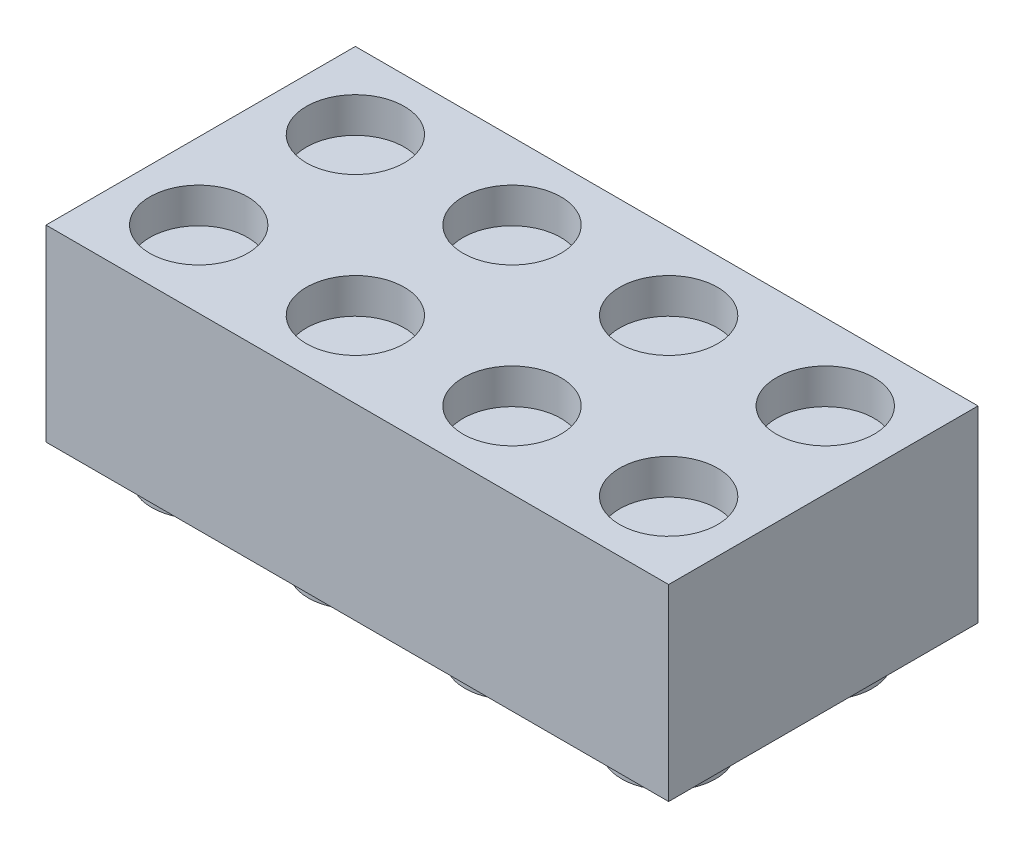
ISO-10303-21;
HEADER;
FILE_DESCRIPTION(('STEP AP214'),'2;1');
FILE_NAME('part.step','',(''),(''),'','','');
FILE_SCHEMA(('AUTOMOTIVE_DESIGN { 1 0 10303 214 1 1 1 1 }'));
ENDSEC;
DATA;
#1=APPLICATION_CONTEXT('core data for automotive mechanical design processes');
#2=APPLICATION_PROTOCOL_DEFINITION('international standard','automotive_design',2000,#1);
#3=PRODUCT_CONTEXT('',#1,'mechanical');
#4=PRODUCT('Part','Part','',(#3));
#5=PRODUCT_RELATED_PRODUCT_CATEGORY('part','',(#4));
#6=PRODUCT_DEFINITION_FORMATION('','',#4);
#7=PRODUCT_DEFINITION_CONTEXT('part definition',#1,'design');
#8=PRODUCT_DEFINITION('design','',#6,#7);
#9=PRODUCT_DEFINITION_SHAPE('','',#8);
#10=(LENGTH_UNIT() NAMED_UNIT(*) SI_UNIT(.MILLI.,.METRE.));
#11=(NAMED_UNIT(*) PLANE_ANGLE_UNIT() SI_UNIT($,.RADIAN.));
#12=(NAMED_UNIT(*) SI_UNIT($,.STERADIAN.) SOLID_ANGLE_UNIT());
#13=UNCERTAINTY_MEASURE_WITH_UNIT(LENGTH_MEASURE(1.E-05),#10,'distance_accuracy_value','');
#14=(GEOMETRIC_REPRESENTATION_CONTEXT(3) GLOBAL_UNCERTAINTY_ASSIGNED_CONTEXT((#13)) GLOBAL_UNIT_ASSIGNED_CONTEXT((#10,
#11,#12)) REPRESENTATION_CONTEXT('',''));
#15=CARTESIAN_POINT('',(0.,0.,0.));
#16=DIRECTION('',(0.,0.,1.));
#17=DIRECTION('',(1.,0.,0.));
#18=AXIS2_PLACEMENT_3D('',#15,#16,#17);
#19=CARTESIAN_POINT('',(0.,9.6,-15.8));
#20=DIRECTION('',(0.,0.,-1.));
#21=DIRECTION('',(-1.,0.,0.));
#22=AXIS2_PLACEMENT_3D('',#19,#20,#21);
#23=PLANE('',#22);
#24=DIRECTION('',(1.,0.,0.));
#25=VECTOR('',#24,1.);
#26=CARTESIAN_POINT('',(0.,0.,-15.8));
#27=LINE('',#26,#25);
#28=CARTESIAN_POINT('',(0.,0.,-15.8));
#29=VERTEX_POINT('',#28);
#30=CARTESIAN_POINT('',(31.8,0.,-15.8));
#31=VERTEX_POINT('',#30);
#32=EDGE_CURVE('E102',#29,#31,#27,.T.);
#33=ORIENTED_EDGE('',*,*,#32,.F.);
#34=DIRECTION('',(0.,-1.,0.));
#35=VECTOR('',#34,1.);
#36=CARTESIAN_POINT('',(0.,9.6,-15.8));
#37=LINE('',#36,#35);
#38=CARTESIAN_POINT('',(0.,9.6,-15.8));
#39=VERTEX_POINT('',#38);
#40=EDGE_CURVE('E50',#39,#29,#37,.T.);
#41=ORIENTED_EDGE('',*,*,#40,.F.);
#42=DIRECTION('',(1.,0.,0.));
#43=VECTOR('',#42,1.);
#44=CARTESIAN_POINT('',(0.,9.6,-15.8));
#45=LINE('',#44,#43);
#46=CARTESIAN_POINT('',(31.8,9.6,-15.8));
#47=VERTEX_POINT('',#46);
#48=EDGE_CURVE('E95',#39,#47,#45,.T.);
#49=ORIENTED_EDGE('',*,*,#48,.T.);
#50=DIRECTION('',(0.,-1.,0.));
#51=VECTOR('',#50,1.);
#52=CARTESIAN_POINT('',(31.8,9.6,-15.8));
#53=LINE('',#52,#51);
#54=EDGE_CURVE('E92',#47,#31,#53,.T.);
#55=ORIENTED_EDGE('',*,*,#54,.T.);
#56=EDGE_LOOP('',(#33,#41,#49,#55));
#57=FACE_BOUND('',#56,.T.);
#58=ADVANCED_FACE('F34',(#57),#23,.T.);
#59=CARTESIAN_POINT('',(0.,9.6,0.));
#60=DIRECTION('',(-1.,0.,0.));
#61=DIRECTION('',(0.,0.,1.));
#62=AXIS2_PLACEMENT_3D('',#59,#60,#61);
#63=PLANE('',#62);
#64=DIRECTION('',(0.,0.,-1.));
#65=VECTOR('',#64,1.);
#66=CARTESIAN_POINT('',(0.,0.,0.));
#67=LINE('',#66,#65);
#68=CARTESIAN_POINT('',(0.,0.,0.));
#69=VERTEX_POINT('',#68);
#70=EDGE_CURVE('E97',#69,#29,#67,.T.);
#71=ORIENTED_EDGE('',*,*,#70,.F.);
#72=DIRECTION('',(0.,-1.,0.));
#73=VECTOR('',#72,1.);
#74=CARTESIAN_POINT('',(0.,9.6,0.));
#75=LINE('',#74,#73);
#76=CARTESIAN_POINT('',(0.,9.6,0.));
#77=VERTEX_POINT('',#76);
#78=EDGE_CURVE('E66',#77,#69,#75,.T.);
#79=ORIENTED_EDGE('',*,*,#78,.F.);
#80=DIRECTION('',(0.,0.,-1.));
#81=VECTOR('',#80,1.);
#82=CARTESIAN_POINT('',(0.,9.6,0.));
#83=LINE('',#82,#81);
#84=EDGE_CURVE('E83',#77,#39,#83,.T.);
#85=ORIENTED_EDGE('',*,*,#84,.T.);
#86=ORIENTED_EDGE('',*,*,#40,.T.);
#87=EDGE_LOOP('',(#71,#79,#85,#86));
#88=FACE_BOUND('',#87,.T.);
#89=ADVANCED_FACE('F154',(#88),#63,.T.);
#90=CARTESIAN_POINT('',(0.,9.6,0.));
#91=DIRECTION('',(0.,0.,-1.));
#92=DIRECTION('',(-1.,0.,0.));
#93=AXIS2_PLACEMENT_3D('',#90,#91,#92);
#94=PLANE('',#93);
#95=DIRECTION('',(1.,0.,0.));
#96=VECTOR('',#95,1.);
#97=CARTESIAN_POINT('',(0.,0.,0.));
#98=LINE('',#97,#96);
#99=CARTESIAN_POINT('',(31.8,0.,0.));
#100=VERTEX_POINT('',#99);
#101=EDGE_CURVE('E88',#69,#100,#98,.T.);
#102=ORIENTED_EDGE('',*,*,#101,.T.);
#103=DIRECTION('',(0.,-1.,0.));
#104=VECTOR('',#103,1.);
#105=CARTESIAN_POINT('',(31.8,9.6,0.));
#106=LINE('',#105,#104);
#107=CARTESIAN_POINT('',(31.8,9.6,0.));
#108=VERTEX_POINT('',#107);
#109=EDGE_CURVE('E86',#108,#100,#106,.T.);
#110=ORIENTED_EDGE('',*,*,#109,.F.);
#111=DIRECTION('',(1.,0.,0.));
#112=VECTOR('',#111,1.);
#113=CARTESIAN_POINT('',(0.,9.6,0.));
#114=LINE('',#113,#112);
#115=EDGE_CURVE('E80',#77,#108,#114,.T.);
#116=ORIENTED_EDGE('',*,*,#115,.F.);
#117=ORIENTED_EDGE('',*,*,#78,.T.);
#118=EDGE_LOOP('',(#102,#110,#116,#117));
#119=FACE_BOUND('',#118,.T.);
#120=ADVANCED_FACE('F87',(#119),#94,.F.);
#121=CARTESIAN_POINT('',(31.8,9.6,0.));
#122=DIRECTION('',(-1.,0.,0.));
#123=DIRECTION('',(0.,0.,1.));
#124=AXIS2_PLACEMENT_3D('',#121,#122,#123);
#125=PLANE('',#124);
#126=DIRECTION('',(0.,0.,-1.));
#127=VECTOR('',#126,1.);
#128=CARTESIAN_POINT('',(31.8,0.,0.));
#129=LINE('',#128,#127);
#130=EDGE_CURVE('E105',#100,#31,#129,.T.);
#131=ORIENTED_EDGE('',*,*,#130,.T.);
#132=ORIENTED_EDGE('',*,*,#54,.F.);
#133=DIRECTION('',(0.,0.,-1.));
#134=VECTOR('',#133,1.);
#135=CARTESIAN_POINT('',(31.8,9.6,0.));
#136=LINE('',#135,#134);
#137=EDGE_CURVE('E77',#108,#47,#136,.T.);
#138=ORIENTED_EDGE('',*,*,#137,.F.);
#139=ORIENTED_EDGE('',*,*,#109,.T.);
#140=EDGE_LOOP('',(#131,#132,#138,#139));
#141=FACE_BOUND('',#140,.T.);
#142=ADVANCED_FACE('F94',(#141),#125,.F.);
#143=CARTESIAN_POINT('',(0.,9.6,0.));
#144=DIRECTION('',(0.,1.,0.));
#145=DIRECTION('',(0.,0.,1.));
#146=AXIS2_PLACEMENT_3D('',#143,#144,#145);
#147=PLANE('',#146);
#148=CARTESIAN_POINT('',(19.9,9.6,-11.8999999999999));
#149=DIRECTION('',(0.,1.,0.));
#150=DIRECTION('',(0.,0.,1.));
#151=AXIS2_PLACEMENT_3D('',#148,#149,#150);
#152=CIRCLE('',#151,2.5);
#153=CARTESIAN_POINT('',(19.9,9.6,-9.39999999999995));
#154=VERTEX_POINT('',#153);
#155=EDGE_CURVE('E303',#154,#154,#152,.T.);
#156=ORIENTED_EDGE('',*,*,#155,.F.);
#157=EDGE_LOOP('',(#156));
#158=FACE_BOUND('',#157,.T.);
#159=CARTESIAN_POINT('',(3.9,9.6,-3.89999999999983));
#160=DIRECTION('',(0.,1.,0.));
#161=DIRECTION('',(0.,0.,1.));
#162=AXIS2_PLACEMENT_3D('',#159,#160,#161);
#163=CIRCLE('',#162,2.5);
#164=CARTESIAN_POINT('',(3.9,9.6,-1.39999999999983));
#165=VERTEX_POINT('',#164);
#166=EDGE_CURVE('E328',#165,#165,#163,.T.);
#167=ORIENTED_EDGE('',*,*,#166,.F.);
#168=EDGE_LOOP('',(#167));
#169=FACE_BOUND('',#168,.T.);
#170=CARTESIAN_POINT('',(11.9,9.6,-3.89999999999989));
#171=DIRECTION('',(0.,1.,0.));
#172=DIRECTION('',(0.,0.,1.));
#173=AXIS2_PLACEMENT_3D('',#170,#171,#172);
#174=CIRCLE('',#173,2.5);
#175=CARTESIAN_POINT('',(11.9,9.6,-1.39999999999989));
#176=VERTEX_POINT('',#175);
#177=EDGE_CURVE('E327',#176,#176,#174,.T.);
#178=ORIENTED_EDGE('',*,*,#177,.F.);
#179=EDGE_LOOP('',(#178));
#180=FACE_BOUND('',#179,.T.);
#181=CARTESIAN_POINT('',(19.9,9.6,-3.89999999999994));
#182=DIRECTION('',(0.,1.,0.));
#183=DIRECTION('',(0.,0.,1.));
#184=AXIS2_PLACEMENT_3D('',#181,#182,#183);
#185=CIRCLE('',#184,2.5);
#186=CARTESIAN_POINT('',(19.9,9.6,-1.39999999999995));
#187=VERTEX_POINT('',#186);
#188=EDGE_CURVE('E337',#187,#187,#185,.T.);
#189=ORIENTED_EDGE('',*,*,#188,.F.);
#190=EDGE_LOOP('',(#189));
#191=FACE_BOUND('',#190,.T.);
#192=CARTESIAN_POINT('',(11.9,9.6,-11.8999999999999));
#193=DIRECTION('',(0.,1.,0.));
#194=DIRECTION('',(0.,0.,1.));
#195=AXIS2_PLACEMENT_3D('',#192,#193,#194);
#196=CIRCLE('',#195,2.5);
#197=CARTESIAN_POINT('',(11.9,9.6,-9.39999999999989));
#198=VERTEX_POINT('',#197);
#199=EDGE_CURVE('E304',#198,#198,#196,.T.);
#200=ORIENTED_EDGE('',*,*,#199,.F.);
#201=EDGE_LOOP('',(#200));
#202=FACE_BOUND('',#201,.T.);
#203=CARTESIAN_POINT('',(3.89999999999997,9.6,-11.8999999999998));
#204=DIRECTION('',(0.,1.,0.));
#205=DIRECTION('',(0.,0.,1.));
#206=AXIS2_PLACEMENT_3D('',#203,#204,#205);
#207=CIRCLE('',#206,2.5);
#208=CARTESIAN_POINT('',(3.89999999999997,9.6,-9.39999999999983));
#209=VERTEX_POINT('',#208);
#210=EDGE_CURVE('E315',#209,#209,#207,.T.);
#211=ORIENTED_EDGE('',*,*,#210,.F.);
#212=EDGE_LOOP('',(#211));
#213=FACE_BOUND('',#212,.T.);
#214=CARTESIAN_POINT('',(27.9,9.6,-11.9));
#215=DIRECTION('',(0.,1.,0.));
#216=DIRECTION('',(0.,0.,1.));
#217=AXIS2_PLACEMENT_3D('',#214,#215,#216);
#218=CIRCLE('',#217,2.5);
#219=CARTESIAN_POINT('',(27.9,9.6,-9.4));
#220=VERTEX_POINT('',#219);
#221=EDGE_CURVE('E321',#220,#220,#218,.T.);
#222=ORIENTED_EDGE('',*,*,#221,.F.);
#223=EDGE_LOOP('',(#222));
#224=FACE_BOUND('',#223,.T.);
#225=CARTESIAN_POINT('',(27.9,9.6,-3.9));
#226=DIRECTION('',(0.,1.,0.));
#227=DIRECTION('',(0.,0.,1.));
#228=AXIS2_PLACEMENT_3D('',#225,#226,#227);
#229=CIRCLE('',#228,2.5);
#230=CARTESIAN_POINT('',(27.9,9.6,-1.4));
#231=VERTEX_POINT('',#230);
#232=EDGE_CURVE('E336',#231,#231,#229,.T.);
#233=ORIENTED_EDGE('',*,*,#232,.F.);
#234=EDGE_LOOP('',(#233));
#235=FACE_BOUND('',#234,.T.);
#236=ORIENTED_EDGE('',*,*,#48,.F.);
#237=ORIENTED_EDGE('',*,*,#84,.F.);
#238=ORIENTED_EDGE('',*,*,#115,.T.);
#239=ORIENTED_EDGE('',*,*,#137,.T.);
#240=EDGE_LOOP('',(#236,#237,#238,#239));
#241=FACE_BOUND('',#240,.T.);
#242=ADVANCED_FACE('F82',(#158,#169,#180,#191,#202,#213,#224,#235,#241),#147,.T.);
#243=CARTESIAN_POINT('',(0.,0.,0.));
#244=DIRECTION('',(0.,1.,0.));
#245=DIRECTION('',(0.,0.,1.));
#246=AXIS2_PLACEMENT_3D('',#243,#244,#245);
#247=PLANE('',#246);
#248=CARTESIAN_POINT('',(27.9000000000001,0.,-11.9));
#249=DIRECTION('',(0.,1.,0.));
#250=DIRECTION('',(0.,0.,1.));
#251=AXIS2_PLACEMENT_3D('',#248,#249,#250);
#252=CIRCLE('',#251,2.4);
#253=CARTESIAN_POINT('',(27.9000000000001,0.,-9.5));
#254=VERTEX_POINT('',#253);
#255=EDGE_CURVE('E11',#254,#254,#252,.F.);
#256=ORIENTED_EDGE('',*,*,#255,.F.);
#257=EDGE_LOOP('',(#256));
#258=FACE_BOUND('',#257,.T.);
#259=CARTESIAN_POINT('',(3.90000000000008,0.,-11.9000000000002));
#260=DIRECTION('',(0.,1.,0.));
#261=DIRECTION('',(0.,0.,1.));
#262=AXIS2_PLACEMENT_3D('',#259,#260,#261);
#263=CIRCLE('',#262,2.4);
#264=CARTESIAN_POINT('',(3.90000000000008,0.,-9.50000000000017));
#265=VERTEX_POINT('',#264);
#266=EDGE_CURVE('E42',#265,#265,#263,.F.);
#267=ORIENTED_EDGE('',*,*,#266,.F.);
#268=EDGE_LOOP('',(#267));
#269=FACE_BOUND('',#268,.T.);
#270=CARTESIAN_POINT('',(11.9000000000001,0.,-11.9000000000001));
#271=DIRECTION('',(0.,1.,0.));
#272=DIRECTION('',(0.,0.,1.));
#273=AXIS2_PLACEMENT_3D('',#270,#271,#272);
#274=CIRCLE('',#273,2.4);
#275=CARTESIAN_POINT('',(11.9000000000001,0.,-9.50000000000011));
#276=VERTEX_POINT('',#275);
#277=EDGE_CURVE('E129',#276,#276,#274,.F.);
#278=ORIENTED_EDGE('',*,*,#277,.F.);
#279=EDGE_LOOP('',(#278));
#280=FACE_BOUND('',#279,.T.);
#281=CARTESIAN_POINT('',(19.9000000000001,0.,-11.9000000000001));
#282=DIRECTION('',(0.,1.,0.));
#283=DIRECTION('',(0.,0.,1.));
#284=AXIS2_PLACEMENT_3D('',#281,#282,#283);
#285=CIRCLE('',#284,2.4);
#286=CARTESIAN_POINT('',(19.9000000000001,0.,-9.50000000000006));
#287=VERTEX_POINT('',#286);
#288=EDGE_CURVE('E126',#287,#287,#285,.F.);
#289=ORIENTED_EDGE('',*,*,#288,.F.);
#290=EDGE_LOOP('',(#289));
#291=FACE_BOUND('',#290,.T.);
#292=CARTESIAN_POINT('',(3.9,0.,-3.90000000000017));
#293=DIRECTION('',(0.,1.,0.));
#294=DIRECTION('',(0.,0.,1.));
#295=AXIS2_PLACEMENT_3D('',#292,#293,#294);
#296=CIRCLE('',#295,2.4);
#297=CARTESIAN_POINT('',(3.9,0.,-1.50000000000017));
#298=VERTEX_POINT('',#297);
#299=EDGE_CURVE('E123',#298,#298,#296,.F.);
#300=ORIENTED_EDGE('',*,*,#299,.F.);
#301=EDGE_LOOP('',(#300));
#302=FACE_BOUND('',#301,.T.);
#303=CARTESIAN_POINT('',(11.9,0.,-3.90000000000011));
#304=DIRECTION('',(0.,1.,0.));
#305=DIRECTION('',(0.,0.,1.));
#306=AXIS2_PLACEMENT_3D('',#303,#304,#305);
#307=CIRCLE('',#306,2.4);
#308=CARTESIAN_POINT('',(11.9,0.,-1.50000000000011));
#309=VERTEX_POINT('',#308);
#310=EDGE_CURVE('E120',#309,#309,#307,.F.);
#311=ORIENTED_EDGE('',*,*,#310,.F.);
#312=EDGE_LOOP('',(#311));
#313=FACE_BOUND('',#312,.T.);
#314=CARTESIAN_POINT('',(19.9,0.,-3.90000000000006));
#315=DIRECTION('',(0.,1.,0.));
#316=DIRECTION('',(0.,0.,1.));
#317=AXIS2_PLACEMENT_3D('',#314,#315,#316);
#318=CIRCLE('',#317,2.4);
#319=CARTESIAN_POINT('',(19.9,0.,-1.50000000000006));
#320=VERTEX_POINT('',#319);
#321=EDGE_CURVE('E117',#320,#320,#318,.F.);
#322=ORIENTED_EDGE('',*,*,#321,.F.);
#323=EDGE_LOOP('',(#322));
#324=FACE_BOUND('',#323,.T.);
#325=CARTESIAN_POINT('',(27.9,0.,-3.9));
#326=DIRECTION('',(0.,1.,0.));
#327=DIRECTION('',(0.,0.,1.));
#328=AXIS2_PLACEMENT_3D('',#325,#326,#327);
#329=CIRCLE('',#328,2.4);
#330=CARTESIAN_POINT('',(27.9,0.,-1.5));
#331=VERTEX_POINT('',#330);
#332=EDGE_CURVE('E112',#331,#331,#329,.F.);
#333=ORIENTED_EDGE('',*,*,#332,.F.);
#334=EDGE_LOOP('',(#333));
#335=FACE_BOUND('',#334,.T.);
#336=ORIENTED_EDGE('',*,*,#32,.T.);
#337=ORIENTED_EDGE('',*,*,#130,.F.);
#338=ORIENTED_EDGE('',*,*,#101,.F.);
#339=ORIENTED_EDGE('',*,*,#70,.T.);
#340=EDGE_LOOP('',(#336,#337,#338,#339));
#341=FACE_BOUND('',#340,.T.);
#342=ADVANCED_FACE('F136',(#258,#269,#280,#291,#302,#313,#324,#335,#341),#247,.F.);
#343=CARTESIAN_POINT('',(27.9,-1.7,-3.9));
#344=DIRECTION('',(0.,1.,0.));
#345=DIRECTION('',(0.,0.,1.));
#346=AXIS2_PLACEMENT_3D('',#343,#344,#345);
#347=CYLINDRICAL_SURFACE('',#346,2.4);
#348=CARTESIAN_POINT('',(27.9,-1.7,-3.9));
#349=DIRECTION('',(0.,-1.,0.));
#350=DIRECTION('',(0.,0.,-1.));
#351=AXIS2_PLACEMENT_3D('',#348,#349,#350);
#352=CIRCLE('',#351,2.4);
#353=CARTESIAN_POINT('',(27.9,-1.7,-6.3));
#354=VERTEX_POINT('',#353);
#355=EDGE_CURVE('E106',#354,#354,#352,.T.);
#356=ORIENTED_EDGE('',*,*,#355,.F.);
#357=EDGE_LOOP('',(#356));
#358=FACE_BOUND('',#357,.T.);
#359=ORIENTED_EDGE('',*,*,#332,.T.);
#360=EDGE_LOOP('',(#359));
#361=FACE_BOUND('',#360,.T.);
#362=ADVANCED_FACE('F139',(#358,#361),#347,.T.);
#363=CARTESIAN_POINT('',(27.9,-1.7,-3.9));
#364=DIRECTION('',(0.,-1.,0.));
#365=DIRECTION('',(0.,0.,-1.));
#366=AXIS2_PLACEMENT_3D('',#363,#364,#365);
#367=PLANE('',#366);
#368=ORIENTED_EDGE('',*,*,#355,.T.);
#369=EDGE_LOOP('',(#368));
#370=FACE_BOUND('',#369,.T.);
#371=ADVANCED_FACE('F175',(#370),#367,.T.);
#372=CARTESIAN_POINT('',(19.9,-1.7,-3.90000000000006));
#373=DIRECTION('',(0.,1.,0.));
#374=DIRECTION('',(0.,0.,1.));
#375=AXIS2_PLACEMENT_3D('',#372,#373,#374);
#376=CYLINDRICAL_SURFACE('',#375,2.4);
#377=CARTESIAN_POINT('',(19.9,-1.7,-3.90000000000006));
#378=DIRECTION('',(0.,-1.,0.));
#379=DIRECTION('',(0.,0.,-1.));
#380=AXIS2_PLACEMENT_3D('',#377,#378,#379);
#381=CIRCLE('',#380,2.4);
#382=CARTESIAN_POINT('',(19.9,-1.7,-6.30000000000006));
#383=VERTEX_POINT('',#382);
#384=EDGE_CURVE('E368',#383,#383,#381,.T.);
#385=ORIENTED_EDGE('',*,*,#384,.F.);
#386=EDGE_LOOP('',(#385));
#387=FACE_BOUND('',#386,.T.);
#388=ORIENTED_EDGE('',*,*,#321,.T.);
#389=EDGE_LOOP('',(#388));
#390=FACE_BOUND('',#389,.T.);
#391=ADVANCED_FACE('F179',(#387,#390),#376,.T.);
#392=CARTESIAN_POINT('',(19.9,-1.7,-3.90000000000006));
#393=DIRECTION('',(0.,-1.,0.));
#394=DIRECTION('',(0.,0.,-1.));
#395=AXIS2_PLACEMENT_3D('',#392,#393,#394);
#396=PLANE('',#395);
#397=ORIENTED_EDGE('',*,*,#384,.T.);
#398=EDGE_LOOP('',(#397));
#399=FACE_BOUND('',#398,.T.);
#400=ADVANCED_FACE('F183',(#399),#396,.T.);
#401=CARTESIAN_POINT('',(11.9,-1.7,-3.90000000000011));
#402=DIRECTION('',(0.,1.,0.));
#403=DIRECTION('',(0.,0.,1.));
#404=AXIS2_PLACEMENT_3D('',#401,#402,#403);
#405=CYLINDRICAL_SURFACE('',#404,2.4);
#406=CARTESIAN_POINT('',(11.9,-1.7,-3.90000000000011));
#407=DIRECTION('',(0.,-1.,0.));
#408=DIRECTION('',(0.,0.,-1.));
#409=AXIS2_PLACEMENT_3D('',#406,#407,#408);
#410=CIRCLE('',#409,2.4);
#411=CARTESIAN_POINT('',(11.9,-1.7,-6.30000000000011));
#412=VERTEX_POINT('',#411);
#413=EDGE_CURVE('E365',#412,#412,#410,.T.);
#414=ORIENTED_EDGE('',*,*,#413,.F.);
#415=EDGE_LOOP('',(#414));
#416=FACE_BOUND('',#415,.T.);
#417=ORIENTED_EDGE('',*,*,#310,.T.);
#418=EDGE_LOOP('',(#417));
#419=FACE_BOUND('',#418,.T.);
#420=ADVANCED_FACE('F187',(#416,#419),#405,.T.);
#421=CARTESIAN_POINT('',(11.9,-1.7,-3.90000000000011));
#422=DIRECTION('',(0.,-1.,0.));
#423=DIRECTION('',(0.,0.,-1.));
#424=AXIS2_PLACEMENT_3D('',#421,#422,#423);
#425=PLANE('',#424);
#426=ORIENTED_EDGE('',*,*,#413,.T.);
#427=EDGE_LOOP('',(#426));
#428=FACE_BOUND('',#427,.T.);
#429=ADVANCED_FACE('F191',(#428),#425,.T.);
#430=CARTESIAN_POINT('',(3.9,-1.7,-3.90000000000017));
#431=DIRECTION('',(0.,1.,0.));
#432=DIRECTION('',(0.,0.,1.));
#433=AXIS2_PLACEMENT_3D('',#430,#431,#432);
#434=CYLINDRICAL_SURFACE('',#433,2.4);
#435=CARTESIAN_POINT('',(3.9,-1.7,-3.90000000000017));
#436=DIRECTION('',(0.,-1.,0.));
#437=DIRECTION('',(0.,0.,-1.));
#438=AXIS2_PLACEMENT_3D('',#435,#436,#437);
#439=CIRCLE('',#438,2.4);
#440=CARTESIAN_POINT('',(3.9,-1.7,-6.30000000000017));
#441=VERTEX_POINT('',#440);
#442=EDGE_CURVE('E362',#441,#441,#439,.T.);
#443=ORIENTED_EDGE('',*,*,#442,.F.);
#444=EDGE_LOOP('',(#443));
#445=FACE_BOUND('',#444,.T.);
#446=ORIENTED_EDGE('',*,*,#299,.T.);
#447=EDGE_LOOP('',(#446));
#448=FACE_BOUND('',#447,.T.);
#449=ADVANCED_FACE('F195',(#445,#448),#434,.T.);
#450=CARTESIAN_POINT('',(3.9,-1.7,-3.90000000000017));
#451=DIRECTION('',(0.,-1.,0.));
#452=DIRECTION('',(0.,0.,-1.));
#453=AXIS2_PLACEMENT_3D('',#450,#451,#452);
#454=PLANE('',#453);
#455=ORIENTED_EDGE('',*,*,#442,.T.);
#456=EDGE_LOOP('',(#455));
#457=FACE_BOUND('',#456,.T.);
#458=ADVANCED_FACE('F199',(#457),#454,.T.);
#459=CARTESIAN_POINT('',(19.9000000000001,-1.7,-11.9000000000001));
#460=DIRECTION('',(0.,1.,0.));
#461=DIRECTION('',(0.,0.,1.));
#462=AXIS2_PLACEMENT_3D('',#459,#460,#461);
#463=CYLINDRICAL_SURFACE('',#462,2.4);
#464=CARTESIAN_POINT('',(19.9000000000001,-1.7,-11.9000000000001));
#465=DIRECTION('',(0.,-1.,0.));
#466=DIRECTION('',(0.,0.,-1.));
#467=AXIS2_PLACEMENT_3D('',#464,#465,#466);
#468=CIRCLE('',#467,2.4);
#469=CARTESIAN_POINT('',(19.9000000000001,-1.7,-14.3000000000001));
#470=VERTEX_POINT('',#469);
#471=EDGE_CURVE('E359',#470,#470,#468,.T.);
#472=ORIENTED_EDGE('',*,*,#471,.F.);
#473=EDGE_LOOP('',(#472));
#474=FACE_BOUND('',#473,.T.);
#475=ORIENTED_EDGE('',*,*,#288,.T.);
#476=EDGE_LOOP('',(#475));
#477=FACE_BOUND('',#476,.T.);
#478=ADVANCED_FACE('F203',(#474,#477),#463,.T.);
#479=CARTESIAN_POINT('',(19.9000000000001,-1.7,-11.9000000000001));
#480=DIRECTION('',(0.,-1.,0.));
#481=DIRECTION('',(0.,0.,-1.));
#482=AXIS2_PLACEMENT_3D('',#479,#480,#481);
#483=PLANE('',#482);
#484=ORIENTED_EDGE('',*,*,#471,.T.);
#485=EDGE_LOOP('',(#484));
#486=FACE_BOUND('',#485,.T.);
#487=ADVANCED_FACE('F207',(#486),#483,.T.);
#488=CARTESIAN_POINT('',(11.9000000000001,-1.7,-11.9000000000001));
#489=DIRECTION('',(0.,1.,0.));
#490=DIRECTION('',(0.,0.,1.));
#491=AXIS2_PLACEMENT_3D('',#488,#489,#490);
#492=CYLINDRICAL_SURFACE('',#491,2.4);
#493=CARTESIAN_POINT('',(11.9000000000001,-1.7,-11.9000000000001));
#494=DIRECTION('',(0.,-1.,0.));
#495=DIRECTION('',(0.,0.,-1.));
#496=AXIS2_PLACEMENT_3D('',#493,#494,#495);
#497=CIRCLE('',#496,2.4);
#498=CARTESIAN_POINT('',(11.9000000000001,-1.7,-14.3000000000001));
#499=VERTEX_POINT('',#498);
#500=EDGE_CURVE('E356',#499,#499,#497,.T.);
#501=ORIENTED_EDGE('',*,*,#500,.F.);
#502=EDGE_LOOP('',(#501));
#503=FACE_BOUND('',#502,.T.);
#504=ORIENTED_EDGE('',*,*,#277,.T.);
#505=EDGE_LOOP('',(#504));
#506=FACE_BOUND('',#505,.T.);
#507=ADVANCED_FACE('F211',(#503,#506),#492,.T.);
#508=CARTESIAN_POINT('',(11.9000000000001,-1.7,-11.9000000000001));
#509=DIRECTION('',(0.,-1.,0.));
#510=DIRECTION('',(0.,0.,-1.));
#511=AXIS2_PLACEMENT_3D('',#508,#509,#510);
#512=PLANE('',#511);
#513=ORIENTED_EDGE('',*,*,#500,.T.);
#514=EDGE_LOOP('',(#513));
#515=FACE_BOUND('',#514,.T.);
#516=ADVANCED_FACE('F215',(#515),#512,.T.);
#517=CARTESIAN_POINT('',(3.90000000000008,-1.7,-11.9000000000002));
#518=DIRECTION('',(0.,1.,0.));
#519=DIRECTION('',(0.,0.,1.));
#520=AXIS2_PLACEMENT_3D('',#517,#518,#519);
#521=CYLINDRICAL_SURFACE('',#520,2.4);
#522=CARTESIAN_POINT('',(3.90000000000008,-1.7,-11.9000000000002));
#523=DIRECTION('',(0.,-1.,0.));
#524=DIRECTION('',(0.,0.,-1.));
#525=AXIS2_PLACEMENT_3D('',#522,#523,#524);
#526=CIRCLE('',#525,2.4);
#527=CARTESIAN_POINT('',(3.90000000000008,-1.7,-14.3000000000002));
#528=VERTEX_POINT('',#527);
#529=EDGE_CURVE('E353',#528,#528,#526,.T.);
#530=ORIENTED_EDGE('',*,*,#529,.F.);
#531=EDGE_LOOP('',(#530));
#532=FACE_BOUND('',#531,.T.);
#533=ORIENTED_EDGE('',*,*,#266,.T.);
#534=EDGE_LOOP('',(#533));
#535=FACE_BOUND('',#534,.T.);
#536=ADVANCED_FACE('F134',(#532,#535),#521,.T.);
#537=CARTESIAN_POINT('',(3.90000000000008,-1.7,-11.9000000000002));
#538=DIRECTION('',(0.,-1.,0.));
#539=DIRECTION('',(0.,0.,-1.));
#540=AXIS2_PLACEMENT_3D('',#537,#538,#539);
#541=PLANE('',#540);
#542=ORIENTED_EDGE('',*,*,#529,.T.);
#543=EDGE_LOOP('',(#542));
#544=FACE_BOUND('',#543,.T.);
#545=ADVANCED_FACE('F222',(#544),#541,.T.);
#546=CARTESIAN_POINT('',(27.9000000000001,-1.7,-11.9));
#547=DIRECTION('',(0.,1.,0.));
#548=DIRECTION('',(0.,0.,1.));
#549=AXIS2_PLACEMENT_3D('',#546,#547,#548);
#550=CYLINDRICAL_SURFACE('',#549,2.4);
#551=CARTESIAN_POINT('',(27.9000000000001,-1.7,-11.9));
#552=DIRECTION('',(0.,-1.,0.));
#553=DIRECTION('',(0.,0.,-1.));
#554=AXIS2_PLACEMENT_3D('',#551,#552,#553);
#555=CIRCLE('',#554,2.4);
#556=CARTESIAN_POINT('',(27.9000000000001,-1.7,-14.3));
#557=VERTEX_POINT('',#556);
#558=EDGE_CURVE('E348',#557,#557,#555,.T.);
#559=ORIENTED_EDGE('',*,*,#558,.F.);
#560=EDGE_LOOP('',(#559));
#561=FACE_BOUND('',#560,.T.);
#562=ORIENTED_EDGE('',*,*,#255,.T.);
#563=EDGE_LOOP('',(#562));
#564=FACE_BOUND('',#563,.T.);
#565=ADVANCED_FACE('F226',(#561,#564),#550,.T.);
#566=CARTESIAN_POINT('',(27.9000000000001,-1.7,-11.9));
#567=DIRECTION('',(0.,-1.,0.));
#568=DIRECTION('',(0.,0.,-1.));
#569=AXIS2_PLACEMENT_3D('',#566,#567,#568);
#570=PLANE('',#569);
#571=ORIENTED_EDGE('',*,*,#558,.T.);
#572=EDGE_LOOP('',(#571));
#573=FACE_BOUND('',#572,.T.);
#574=ADVANCED_FACE('F230',(#573),#570,.T.);
#575=CARTESIAN_POINT('',(27.9,7.8,-3.9));
#576=DIRECTION('',(0.,1.,0.));
#577=DIRECTION('',(0.,0.,1.));
#578=AXIS2_PLACEMENT_3D('',#575,#576,#577);
#579=CYLINDRICAL_SURFACE('',#578,2.5);
#580=CARTESIAN_POINT('',(27.9,7.8,-3.9));
#581=DIRECTION('',(0.,1.,0.));
#582=DIRECTION('',(0.,0.,1.));
#583=AXIS2_PLACEMENT_3D('',#580,#581,#582);
#584=CIRCLE('',#583,2.5);
#585=CARTESIAN_POINT('',(27.9,7.8,-1.4));
#586=VERTEX_POINT('',#585);
#587=EDGE_CURVE('E345',#586,#586,#584,.T.);
#588=ORIENTED_EDGE('',*,*,#587,.F.);
#589=EDGE_LOOP('',(#588));
#590=FACE_BOUND('',#589,.T.);
#591=ORIENTED_EDGE('',*,*,#232,.T.);
#592=EDGE_LOOP('',(#591));
#593=FACE_BOUND('',#592,.T.);
#594=ADVANCED_FACE('F234',(#590,#593),#579,.F.);
#595=CARTESIAN_POINT('',(27.9,7.8,-3.9));
#596=DIRECTION('',(0.,1.,0.));
#597=DIRECTION('',(0.,0.,1.));
#598=AXIS2_PLACEMENT_3D('',#595,#596,#597);
#599=PLANE('',#598);
#600=ORIENTED_EDGE('',*,*,#587,.T.);
#601=EDGE_LOOP('',(#600));
#602=FACE_BOUND('',#601,.T.);
#603=ADVANCED_FACE('F238',(#602),#599,.T.);
#604=CARTESIAN_POINT('',(27.9,7.8,-11.9));
#605=DIRECTION('',(0.,1.,0.));
#606=DIRECTION('',(0.,0.,1.));
#607=AXIS2_PLACEMENT_3D('',#604,#605,#606);
#608=CYLINDRICAL_SURFACE('',#607,2.5);
#609=CARTESIAN_POINT('',(27.9,7.8,-11.9));
#610=DIRECTION('',(0.,1.,0.));
#611=DIRECTION('',(0.,0.,1.));
#612=AXIS2_PLACEMENT_3D('',#609,#610,#611);
#613=CIRCLE('',#612,2.5);
#614=CARTESIAN_POINT('',(27.9,7.8,-9.4));
#615=VERTEX_POINT('',#614);
#616=EDGE_CURVE('E318',#615,#615,#613,.T.);
#617=ORIENTED_EDGE('',*,*,#616,.F.);
#618=EDGE_LOOP('',(#617));
#619=FACE_BOUND('',#618,.T.);
#620=ORIENTED_EDGE('',*,*,#221,.T.);
#621=EDGE_LOOP('',(#620));
#622=FACE_BOUND('',#621,.T.);
#623=ADVANCED_FACE('F242',(#619,#622),#608,.F.);
#624=CARTESIAN_POINT('',(27.9,7.8,-11.9));
#625=DIRECTION('',(0.,1.,0.));
#626=DIRECTION('',(0.,0.,1.));
#627=AXIS2_PLACEMENT_3D('',#624,#625,#626);
#628=PLANE('',#627);
#629=ORIENTED_EDGE('',*,*,#616,.T.);
#630=EDGE_LOOP('',(#629));
#631=FACE_BOUND('',#630,.T.);
#632=ADVANCED_FACE('F279',(#631),#628,.T.);
#633=CARTESIAN_POINT('',(3.89999999999997,7.8,-11.8999999999998));
#634=DIRECTION('',(0.,1.,0.));
#635=DIRECTION('',(0.,0.,1.));
#636=AXIS2_PLACEMENT_3D('',#633,#634,#635);
#637=CYLINDRICAL_SURFACE('',#636,2.5);
#638=CARTESIAN_POINT('',(3.89999999999997,7.8,-11.8999999999998));
#639=DIRECTION('',(0.,1.,0.));
#640=DIRECTION('',(0.,0.,1.));
#641=AXIS2_PLACEMENT_3D('',#638,#639,#640);
#642=CIRCLE('',#641,2.5);
#643=CARTESIAN_POINT('',(3.89999999999997,7.8,-9.39999999999983));
#644=VERTEX_POINT('',#643);
#645=EDGE_CURVE('E310',#644,#644,#642,.T.);
#646=ORIENTED_EDGE('',*,*,#645,.F.);
#647=EDGE_LOOP('',(#646));
#648=FACE_BOUND('',#647,.T.);
#649=ORIENTED_EDGE('',*,*,#210,.T.);
#650=EDGE_LOOP('',(#649));
#651=FACE_BOUND('',#650,.T.);
#652=ADVANCED_FACE('F283',(#648,#651),#637,.F.);
#653=CARTESIAN_POINT('',(3.89999999999997,7.8,-11.8999999999998));
#654=DIRECTION('',(0.,1.,0.));
#655=DIRECTION('',(0.,0.,1.));
#656=AXIS2_PLACEMENT_3D('',#653,#654,#655);
#657=PLANE('',#656);
#658=ORIENTED_EDGE('',*,*,#645,.T.);
#659=EDGE_LOOP('',(#658));
#660=FACE_BOUND('',#659,.T.);
#661=ADVANCED_FACE('F287',(#660),#657,.T.);
#662=CARTESIAN_POINT('',(11.9,7.8,-11.8999999999999));
#663=DIRECTION('',(0.,1.,0.));
#664=DIRECTION('',(0.,0.,1.));
#665=AXIS2_PLACEMENT_3D('',#662,#663,#664);
#666=CYLINDRICAL_SURFACE('',#665,2.5);
#667=CARTESIAN_POINT('',(11.9,7.8,-11.8999999999999));
#668=DIRECTION('',(0.,1.,0.));
#669=DIRECTION('',(0.,0.,1.));
#670=AXIS2_PLACEMENT_3D('',#667,#668,#669);
#671=CIRCLE('',#670,2.5);
#672=CARTESIAN_POINT('',(11.9,7.8,-9.39999999999989));
#673=VERTEX_POINT('',#672);
#674=EDGE_CURVE('E302',#673,#673,#671,.T.);
#675=ORIENTED_EDGE('',*,*,#674,.F.);
#676=EDGE_LOOP('',(#675));
#677=FACE_BOUND('',#676,.T.);
#678=ORIENTED_EDGE('',*,*,#199,.T.);
#679=EDGE_LOOP('',(#678));
#680=FACE_BOUND('',#679,.T.);
#681=ADVANCED_FACE('F291',(#677,#680),#666,.F.);
#682=CARTESIAN_POINT('',(11.9,7.8,-11.8999999999999));
#683=DIRECTION('',(0.,1.,0.));
#684=DIRECTION('',(0.,0.,1.));
#685=AXIS2_PLACEMENT_3D('',#682,#683,#684);
#686=PLANE('',#685);
#687=ORIENTED_EDGE('',*,*,#674,.T.);
#688=EDGE_LOOP('',(#687));
#689=FACE_BOUND('',#688,.T.);
#690=ADVANCED_FACE('F257',(#689),#686,.T.);
#691=CARTESIAN_POINT('',(19.9,7.8,-3.89999999999994));
#692=DIRECTION('',(0.,1.,0.));
#693=DIRECTION('',(0.,0.,1.));
#694=AXIS2_PLACEMENT_3D('',#691,#692,#693);
#695=CYLINDRICAL_SURFACE('',#694,2.5);
#696=CARTESIAN_POINT('',(19.9,7.8,-3.89999999999994));
#697=DIRECTION('',(0.,1.,0.));
#698=DIRECTION('',(0.,0.,1.));
#699=AXIS2_PLACEMENT_3D('',#696,#697,#698);
#700=CIRCLE('',#699,2.5);
#701=CARTESIAN_POINT('',(19.9,7.8,-1.39999999999995));
#702=VERTEX_POINT('',#701);
#703=EDGE_CURVE('E333',#702,#702,#700,.T.);
#704=ORIENTED_EDGE('',*,*,#703,.F.);
#705=EDGE_LOOP('',(#704));
#706=FACE_BOUND('',#705,.T.);
#707=ORIENTED_EDGE('',*,*,#188,.T.);
#708=EDGE_LOOP('',(#707));
#709=FACE_BOUND('',#708,.T.);
#710=ADVANCED_FACE('F254',(#706,#709),#695,.F.);
#711=CARTESIAN_POINT('',(19.9,7.8,-3.89999999999994));
#712=DIRECTION('',(0.,1.,0.));
#713=DIRECTION('',(0.,0.,1.));
#714=AXIS2_PLACEMENT_3D('',#711,#712,#713);
#715=PLANE('',#714);
#716=ORIENTED_EDGE('',*,*,#703,.T.);
#717=EDGE_LOOP('',(#716));
#718=FACE_BOUND('',#717,.T.);
#719=ADVANCED_FACE('F248',(#718),#715,.T.);
#720=CARTESIAN_POINT('',(11.9,7.8,-3.89999999999989));
#721=DIRECTION('',(0.,1.,0.));
#722=DIRECTION('',(0.,0.,1.));
#723=AXIS2_PLACEMENT_3D('',#720,#721,#722);
#724=CYLINDRICAL_SURFACE('',#723,2.5);
#725=CARTESIAN_POINT('',(11.9,7.8,-3.89999999999989));
#726=DIRECTION('',(0.,1.,0.));
#727=DIRECTION('',(0.,0.,1.));
#728=AXIS2_PLACEMENT_3D('',#725,#726,#727);
#729=CIRCLE('',#728,2.5);
#730=CARTESIAN_POINT('',(11.9,7.8,-1.39999999999989));
#731=VERTEX_POINT('',#730);
#732=EDGE_CURVE('E340',#731,#731,#729,.T.);
#733=ORIENTED_EDGE('',*,*,#732,.F.);
#734=EDGE_LOOP('',(#733));
#735=FACE_BOUND('',#734,.T.);
#736=ORIENTED_EDGE('',*,*,#177,.T.);
#737=EDGE_LOOP('',(#736));
#738=FACE_BOUND('',#737,.T.);
#739=ADVANCED_FACE('F244',(#735,#738),#724,.F.);
#740=CARTESIAN_POINT('',(11.9,7.8,-3.89999999999989));
#741=DIRECTION('',(0.,1.,0.));
#742=DIRECTION('',(0.,0.,1.));
#743=AXIS2_PLACEMENT_3D('',#740,#741,#742);
#744=PLANE('',#743);
#745=ORIENTED_EDGE('',*,*,#732,.T.);
#746=EDGE_LOOP('',(#745));
#747=FACE_BOUND('',#746,.T.);
#748=ADVANCED_FACE('F247',(#747),#744,.T.);
#749=CARTESIAN_POINT('',(3.9,7.8,-3.89999999999983));
#750=DIRECTION('',(0.,1.,0.));
#751=DIRECTION('',(0.,0.,1.));
#752=AXIS2_PLACEMENT_3D('',#749,#750,#751);
#753=CYLINDRICAL_SURFACE('',#752,2.5);
#754=CARTESIAN_POINT('',(3.9,7.8,-3.89999999999983));
#755=DIRECTION('',(0.,1.,0.));
#756=DIRECTION('',(0.,0.,1.));
#757=AXIS2_PLACEMENT_3D('',#754,#755,#756);
#758=CIRCLE('',#757,2.5);
#759=CARTESIAN_POINT('',(3.9,7.8,-1.39999999999983));
#760=VERTEX_POINT('',#759);
#761=EDGE_CURVE('E324',#760,#760,#758,.T.);
#762=ORIENTED_EDGE('',*,*,#761,.F.);
#763=EDGE_LOOP('',(#762));
#764=FACE_BOUND('',#763,.T.);
#765=ORIENTED_EDGE('',*,*,#166,.T.);
#766=EDGE_LOOP('',(#765));
#767=FACE_BOUND('',#766,.T.);
#768=ADVANCED_FACE('F252',(#764,#767),#753,.F.);
#769=CARTESIAN_POINT('',(3.9,7.8,-3.89999999999983));
#770=DIRECTION('',(0.,1.,0.));
#771=DIRECTION('',(0.,0.,1.));
#772=AXIS2_PLACEMENT_3D('',#769,#770,#771);
#773=PLANE('',#772);
#774=ORIENTED_EDGE('',*,*,#761,.T.);
#775=EDGE_LOOP('',(#774));
#776=FACE_BOUND('',#775,.T.);
#777=ADVANCED_FACE('F266',(#776),#773,.T.);
#778=CARTESIAN_POINT('',(19.9,7.8,-11.8999999999999));
#779=DIRECTION('',(0.,1.,0.));
#780=DIRECTION('',(0.,0.,1.));
#781=AXIS2_PLACEMENT_3D('',#778,#779,#780);
#782=CYLINDRICAL_SURFACE('',#781,2.5);
#783=CARTESIAN_POINT('',(19.9,7.8,-11.8999999999999));
#784=DIRECTION('',(0.,1.,0.));
#785=DIRECTION('',(0.,0.,1.));
#786=AXIS2_PLACEMENT_3D('',#783,#784,#785);
#787=CIRCLE('',#786,2.5);
#788=CARTESIAN_POINT('',(19.9,7.8,-9.39999999999995));
#789=VERTEX_POINT('',#788);
#790=EDGE_CURVE('E307',#789,#789,#787,.T.);
#791=ORIENTED_EDGE('',*,*,#790,.F.);
#792=EDGE_LOOP('',(#791));
#793=FACE_BOUND('',#792,.T.);
#794=ORIENTED_EDGE('',*,*,#155,.T.);
#795=EDGE_LOOP('',(#794));
#796=FACE_BOUND('',#795,.T.);
#797=ADVANCED_FACE('F262',(#793,#796),#782,.F.);
#798=CARTESIAN_POINT('',(19.9,7.8,-11.8999999999999));
#799=DIRECTION('',(0.,1.,0.));
#800=DIRECTION('',(0.,0.,1.));
#801=AXIS2_PLACEMENT_3D('',#798,#799,#800);
#802=PLANE('',#801);
#803=ORIENTED_EDGE('',*,*,#790,.T.);
#804=EDGE_LOOP('',(#803));
#805=FACE_BOUND('',#804,.T.);
#806=ADVANCED_FACE('F265',(#805),#802,.T.);
#807=CLOSED_SHELL('',(#58,#89,#120,#142,#242,#342,#362,#371,#391,#400,#420,#429,#449,#458,#478,
#487,#507,#516,#536,#545,#565,#574,#594,#603,#623,#632,#652,#661,#681,#690,#710,#719,#739,#748,
#768,#777,#797,#806));
#808=MANIFOLD_SOLID_BREP('B2',#807);
#809=ADVANCED_BREP_SHAPE_REPRESENTATION('',(#18,#808),#14);
#810=SHAPE_DEFINITION_REPRESENTATION(#9,#809);
ENDSEC;
END-ISO-10303-21;
